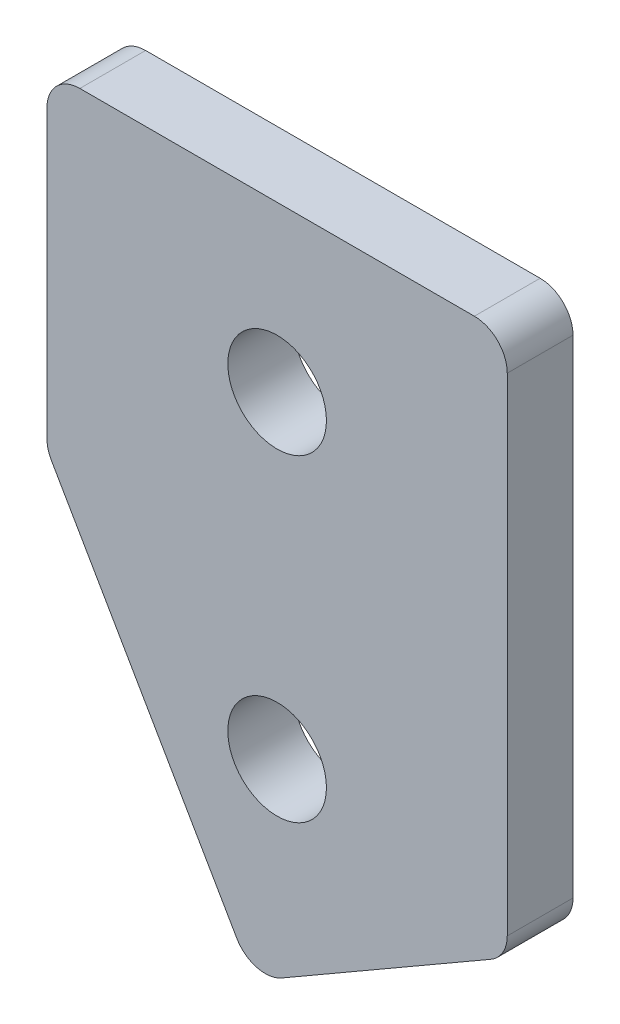
ISO-10303-21;
HEADER;
FILE_DESCRIPTION(('STEP AP214'),'2;1');
FILE_NAME('part.step','',(''),(''),'','','');
FILE_SCHEMA(('AUTOMOTIVE_DESIGN { 1 0 10303 214 1 1 1 1 }'));
ENDSEC;
DATA;
#1=APPLICATION_CONTEXT('core data for automotive mechanical design processes');
#2=APPLICATION_PROTOCOL_DEFINITION('international standard','automotive_design',2000,#1);
#3=PRODUCT_CONTEXT('',#1,'mechanical');
#4=PRODUCT('Part','Part','',(#3));
#5=PRODUCT_RELATED_PRODUCT_CATEGORY('part','',(#4));
#6=PRODUCT_DEFINITION_FORMATION('','',#4);
#7=PRODUCT_DEFINITION_CONTEXT('part definition',#1,'design');
#8=PRODUCT_DEFINITION('design','',#6,#7);
#9=PRODUCT_DEFINITION_SHAPE('','',#8);
#10=(LENGTH_UNIT() NAMED_UNIT(*) SI_UNIT(.MILLI.,.METRE.));
#11=(NAMED_UNIT(*) PLANE_ANGLE_UNIT() SI_UNIT($,.RADIAN.));
#12=(NAMED_UNIT(*) SI_UNIT($,.STERADIAN.) SOLID_ANGLE_UNIT());
#13=UNCERTAINTY_MEASURE_WITH_UNIT(LENGTH_MEASURE(1.E-05),#10,'distance_accuracy_value','');
#14=(GEOMETRIC_REPRESENTATION_CONTEXT(3) GLOBAL_UNCERTAINTY_ASSIGNED_CONTEXT((#13)) GLOBAL_UNIT_ASSIGNED_CONTEXT((#10,
#11,#12)) REPRESENTATION_CONTEXT('',''));
#15=CARTESIAN_POINT('',(0.,0.,0.));
#16=DIRECTION('',(0.,0.,1.));
#17=DIRECTION('',(1.,0.,0.));
#18=AXIS2_PLACEMENT_3D('',#15,#16,#17);
#19=CARTESIAN_POINT('',(0.,0.,2.));
#20=DIRECTION('',(0.,0.,-1.));
#21=DIRECTION('',(-1.,0.,0.));
#22=AXIS2_PLACEMENT_3D('',#19,#20,#21);
#23=PLANE('',#22);
#24=DIRECTION('',(0.500000000000001,-0.866025403784438,0.));
#25=VECTOR('',#24,1.);
#26=CARTESIAN_POINT('',(6.27216931783669,-10.8637159321677,2.));
#27=LINE('',#26,#25);
#28=CARTESIAN_POINT('',(0.133974596215564,-0.232050807568881,2.));
#29=VERTEX_POINT('',#28);
#30=CARTESIAN_POINT('',(5.77216931783669,-9.99769052838329,2.));
#31=VERTEX_POINT('',#30);
#32=EDGE_CURVE('E205',#29,#31,#27,.T.);
#33=ORIENTED_EDGE('',*,*,#32,.T.);
#34=CARTESIAN_POINT('',(6.63819472162113,-9.49769052838329,2.));
#35=DIRECTION('',(0.,0.,-1.));
#36=DIRECTION('',(-1.,0.,0.));
#37=AXIS2_PLACEMENT_3D('',#34,#35,#36);
#38=CIRCLE('',#37,1.);
#39=CARTESIAN_POINT('',(7.13819472162113,-10.3637159321677,2.));
#40=VERTEX_POINT('',#39);
#41=EDGE_CURVE('E174',#31,#40,#38,.F.);
#42=ORIENTED_EDGE('',*,*,#41,.T.);
#43=DIRECTION('',(0.866025403784438,0.500000000000002,0.));
#44=VECTOR('',#43,1.);
#45=CARTESIAN_POINT('',(14.,-6.40205080756887,2.));
#46=LINE('',#45,#44);
#47=CARTESIAN_POINT('',(13.5,-6.69072594216368,2.));
#48=VERTEX_POINT('',#47);
#49=EDGE_CURVE('E137',#40,#48,#46,.T.);
#50=ORIENTED_EDGE('',*,*,#49,.T.);
#51=CARTESIAN_POINT('',(13.,-5.82470053837924,2.));
#52=DIRECTION('',(0.,0.,-1.));
#53=DIRECTION('',(-1.,0.,0.));
#54=AXIS2_PLACEMENT_3D('',#51,#52,#53);
#55=CIRCLE('',#54,1.);
#56=CARTESIAN_POINT('',(14.,-5.82470053837924,2.));
#57=VERTEX_POINT('',#56);
#58=EDGE_CURVE('E172',#48,#57,#55,.F.);
#59=ORIENTED_EDGE('',*,*,#58,.T.);
#60=DIRECTION('',(0.,1.,0.));
#61=VECTOR('',#60,1.);
#62=CARTESIAN_POINT('',(14.,10.,2.));
#63=LINE('',#62,#61);
#64=CARTESIAN_POINT('',(14.,9.,2.));
#65=VERTEX_POINT('',#64);
#66=EDGE_CURVE('E202',#57,#65,#63,.T.);
#67=ORIENTED_EDGE('',*,*,#66,.T.);
#68=CARTESIAN_POINT('',(13.,9.,2.));
#69=DIRECTION('',(0.,0.,-1.));
#70=DIRECTION('',(-1.,0.,0.));
#71=AXIS2_PLACEMENT_3D('',#68,#69,#70);
#72=CIRCLE('',#71,1.);
#73=CARTESIAN_POINT('',(13.,10.,2.));
#74=VERTEX_POINT('',#73);
#75=EDGE_CURVE('E61',#65,#74,#72,.F.);
#76=ORIENTED_EDGE('',*,*,#75,.T.);
#77=DIRECTION('',(-1.,0.,0.));
#78=VECTOR('',#77,1.);
#79=CARTESIAN_POINT('',(0.,10.,2.));
#80=LINE('',#79,#78);
#81=CARTESIAN_POINT('',(1.,10.,2.));
#82=VERTEX_POINT('',#81);
#83=EDGE_CURVE('E156',#74,#82,#80,.T.);
#84=ORIENTED_EDGE('',*,*,#83,.T.);
#85=CARTESIAN_POINT('',(1.,9.,2.));
#86=DIRECTION('',(0.,0.,-1.));
#87=DIRECTION('',(-1.,0.,0.));
#88=AXIS2_PLACEMENT_3D('',#85,#86,#87);
#89=CIRCLE('',#88,1.);
#90=CARTESIAN_POINT('',(0.,9.,2.));
#91=VERTEX_POINT('',#90);
#92=EDGE_CURVE('E167',#82,#91,#89,.F.);
#93=ORIENTED_EDGE('',*,*,#92,.T.);
#94=DIRECTION('',(0.,-1.,0.));
#95=VECTOR('',#94,1.);
#96=CARTESIAN_POINT('',(0.,0.,2.));
#97=LINE('',#96,#95);
#98=CARTESIAN_POINT('',(0.,0.267949192431125,2.));
#99=VERTEX_POINT('',#98);
#100=EDGE_CURVE('E155',#91,#99,#97,.T.);
#101=ORIENTED_EDGE('',*,*,#100,.T.);
#102=CARTESIAN_POINT('',(1.,0.267949192431125,2.));
#103=DIRECTION('',(0.,0.,-1.));
#104=DIRECTION('',(-1.,0.,0.));
#105=AXIS2_PLACEMENT_3D('',#102,#103,#104);
#106=CIRCLE('',#105,1.);
#107=EDGE_CURVE('E169',#99,#29,#106,.F.);
#108=ORIENTED_EDGE('',*,*,#107,.T.);
#109=EDGE_LOOP('',(#33,#42,#50,#59,#67,#76,#84,#93,#101,#108));
#110=FACE_BOUND('',#109,.T.);
#111=CARTESIAN_POINT('',(7.,5.,2.));
#112=DIRECTION('',(0.,0.,1.));
#113=DIRECTION('',(1.,0.,0.));
#114=AXIS2_PLACEMENT_3D('',#111,#112,#113);
#115=CIRCLE('',#114,1.5);
#116=CARTESIAN_POINT('',(8.5,5.,2.));
#117=VERTEX_POINT('',#116);
#118=EDGE_CURVE('E196',#117,#117,#115,.T.);
#119=ORIENTED_EDGE('',*,*,#118,.F.);
#120=EDGE_LOOP('',(#119));
#121=FACE_BOUND('',#120,.T.);
#122=CARTESIAN_POINT('',(7.,-4.67,2.));
#123=DIRECTION('',(0.,0.,1.));
#124=DIRECTION('',(1.,0.,0.));
#125=AXIS2_PLACEMENT_3D('',#122,#123,#124);
#126=CIRCLE('',#125,1.5);
#127=CARTESIAN_POINT('',(8.5,-4.67,2.));
#128=VERTEX_POINT('',#127);
#129=EDGE_CURVE('E210',#128,#128,#126,.T.);
#130=ORIENTED_EDGE('',*,*,#129,.F.);
#131=EDGE_LOOP('',(#130));
#132=FACE_BOUND('',#131,.T.);
#133=ADVANCED_FACE('F39',(#110,#121,#132),#23,.F.);
#134=CARTESIAN_POINT('',(0.,0.,0.));
#135=DIRECTION('',(0.,0.,-1.));
#136=DIRECTION('',(-1.,0.,0.));
#137=AXIS2_PLACEMENT_3D('',#134,#135,#136);
#138=PLANE('',#137);
#139=CARTESIAN_POINT('',(7.,5.,0.));
#140=DIRECTION('',(0.,0.,1.));
#141=DIRECTION('',(1.,0.,0.));
#142=AXIS2_PLACEMENT_3D('',#139,#140,#141);
#143=CIRCLE('',#142,1.5);
#144=CARTESIAN_POINT('',(8.5,5.,0.));
#145=VERTEX_POINT('',#144);
#146=EDGE_CURVE('E198',#145,#145,#143,.T.);
#147=ORIENTED_EDGE('',*,*,#146,.T.);
#148=EDGE_LOOP('',(#147));
#149=FACE_BOUND('',#148,.T.);
#150=DIRECTION('',(0.866025403784438,0.500000000000002,0.));
#151=VECTOR('',#150,1.);
#152=CARTESIAN_POINT('',(14.,-6.40205080756887,0.));
#153=LINE('',#152,#151);
#154=CARTESIAN_POINT('',(7.13819472162113,-10.3637159321677,0.));
#155=VERTEX_POINT('',#154);
#156=CARTESIAN_POINT('',(13.5,-6.69072594216368,0.));
#157=VERTEX_POINT('',#156);
#158=EDGE_CURVE('E134',#155,#157,#153,.T.);
#159=ORIENTED_EDGE('',*,*,#158,.F.);
#160=CARTESIAN_POINT('',(6.63819472162113,-9.49769052838329,0.));
#161=DIRECTION('',(0.,0.,-1.));
#162=DIRECTION('',(-1.,0.,0.));
#163=AXIS2_PLACEMENT_3D('',#160,#161,#162);
#164=CIRCLE('',#163,1.);
#165=CARTESIAN_POINT('',(5.77216931783669,-9.99769052838329,0.));
#166=VERTEX_POINT('',#165);
#167=EDGE_CURVE('E117',#155,#166,#164,.T.);
#168=ORIENTED_EDGE('',*,*,#167,.T.);
#169=DIRECTION('',(0.500000000000001,-0.866025403784438,0.));
#170=VECTOR('',#169,1.);
#171=CARTESIAN_POINT('',(6.27216931783669,-10.8637159321677,0.));
#172=LINE('',#171,#170);
#173=CARTESIAN_POINT('',(0.133974596215564,-0.232050807568881,0.));
#174=VERTEX_POINT('',#173);
#175=EDGE_CURVE('E145',#174,#166,#172,.T.);
#176=ORIENTED_EDGE('',*,*,#175,.F.);
#177=CARTESIAN_POINT('',(1.,0.267949192431125,0.));
#178=DIRECTION('',(0.,0.,-1.));
#179=DIRECTION('',(-1.,0.,0.));
#180=AXIS2_PLACEMENT_3D('',#177,#178,#179);
#181=CIRCLE('',#180,1.);
#182=CARTESIAN_POINT('',(0.,0.267949192431125,0.));
#183=VERTEX_POINT('',#182);
#184=EDGE_CURVE('E159',#174,#183,#181,.T.);
#185=ORIENTED_EDGE('',*,*,#184,.T.);
#186=DIRECTION('',(0.,-1.,0.));
#187=VECTOR('',#186,1.);
#188=CARTESIAN_POINT('',(0.,0.,0.));
#189=LINE('',#188,#187);
#190=CARTESIAN_POINT('',(0.,9.,0.));
#191=VERTEX_POINT('',#190);
#192=EDGE_CURVE('E150',#191,#183,#189,.T.);
#193=ORIENTED_EDGE('',*,*,#192,.F.);
#194=CARTESIAN_POINT('',(1.,9.,0.));
#195=DIRECTION('',(0.,0.,-1.));
#196=DIRECTION('',(-1.,0.,0.));
#197=AXIS2_PLACEMENT_3D('',#194,#195,#196);
#198=CIRCLE('',#197,1.);
#199=CARTESIAN_POINT('',(1.,10.,0.));
#200=VERTEX_POINT('',#199);
#201=EDGE_CURVE('E138',#191,#200,#198,.T.);
#202=ORIENTED_EDGE('',*,*,#201,.T.);
#203=DIRECTION('',(-1.,0.,0.));
#204=VECTOR('',#203,1.);
#205=CARTESIAN_POINT('',(0.,10.,0.));
#206=LINE('',#205,#204);
#207=CARTESIAN_POINT('',(13.,10.,0.));
#208=VERTEX_POINT('',#207);
#209=EDGE_CURVE('E148',#208,#200,#206,.T.);
#210=ORIENTED_EDGE('',*,*,#209,.F.);
#211=CARTESIAN_POINT('',(13.,9.,0.));
#212=DIRECTION('',(0.,0.,-1.));
#213=DIRECTION('',(-1.,0.,0.));
#214=AXIS2_PLACEMENT_3D('',#211,#212,#213);
#215=CIRCLE('',#214,1.);
#216=CARTESIAN_POINT('',(14.,9.,0.));
#217=VERTEX_POINT('',#216);
#218=EDGE_CURVE('E161',#208,#217,#215,.T.);
#219=ORIENTED_EDGE('',*,*,#218,.T.);
#220=DIRECTION('',(0.,1.,0.));
#221=VECTOR('',#220,1.);
#222=CARTESIAN_POINT('',(14.,10.,0.));
#223=LINE('',#222,#221);
#224=CARTESIAN_POINT('',(14.,-5.82470053837924,0.));
#225=VERTEX_POINT('',#224);
#226=EDGE_CURVE('E144',#225,#217,#223,.T.);
#227=ORIENTED_EDGE('',*,*,#226,.F.);
#228=CARTESIAN_POINT('',(13.,-5.82470053837924,0.));
#229=DIRECTION('',(0.,0.,-1.));
#230=DIRECTION('',(-1.,0.,0.));
#231=AXIS2_PLACEMENT_3D('',#228,#229,#230);
#232=CIRCLE('',#231,1.);
#233=EDGE_CURVE('E128',#225,#157,#232,.T.);
#234=ORIENTED_EDGE('',*,*,#233,.T.);
#235=EDGE_LOOP('',(#159,#168,#176,#185,#193,#202,#210,#219,#227,#234));
#236=FACE_BOUND('',#235,.T.);
#237=CARTESIAN_POINT('',(7.,-4.67,0.));
#238=DIRECTION('',(0.,0.,1.));
#239=DIRECTION('',(1.,0.,0.));
#240=AXIS2_PLACEMENT_3D('',#237,#238,#239);
#241=CIRCLE('',#240,1.5);
#242=CARTESIAN_POINT('',(8.5,-4.67,0.));
#243=VERTEX_POINT('',#242);
#244=EDGE_CURVE('E212',#243,#243,#241,.T.);
#245=ORIENTED_EDGE('',*,*,#244,.T.);
#246=EDGE_LOOP('',(#245));
#247=FACE_BOUND('',#246,.T.);
#248=ADVANCED_FACE('F141',(#149,#236,#247),#138,.T.);
#249=CARTESIAN_POINT('',(0.,0.,2.));
#250=DIRECTION('',(1.,0.,0.));
#251=DIRECTION('',(0.,0.,-1.));
#252=AXIS2_PLACEMENT_3D('',#249,#250,#251);
#253=PLANE('',#252);
#254=ORIENTED_EDGE('',*,*,#192,.T.);
#255=DIRECTION('',(0.,0.,-1.));
#256=VECTOR('',#255,1.);
#257=CARTESIAN_POINT('',(0.,0.267949192431125,2.));
#258=LINE('',#257,#256);
#259=EDGE_CURVE('E11',#183,#99,#258,.F.);
#260=ORIENTED_EDGE('',*,*,#259,.T.);
#261=ORIENTED_EDGE('',*,*,#100,.F.);
#262=DIRECTION('',(0.,0.,-1.));
#263=VECTOR('',#262,1.);
#264=CARTESIAN_POINT('',(0.,9.,2.));
#265=LINE('',#264,#263);
#266=EDGE_CURVE('E47',#91,#191,#265,.T.);
#267=ORIENTED_EDGE('',*,*,#266,.T.);
#268=EDGE_LOOP('',(#254,#260,#261,#267));
#269=FACE_BOUND('',#268,.T.);
#270=ADVANCED_FACE('F190',(#269),#253,.F.);
#271=CARTESIAN_POINT('',(6.27216931783669,-10.8637159321677,2.));
#272=DIRECTION('',(0.866025403784438,0.500000000000001,0.));
#273=DIRECTION('',(-0.500000000000001,0.866025403784438,0.));
#274=AXIS2_PLACEMENT_3D('',#271,#272,#273);
#275=PLANE('',#274);
#276=ORIENTED_EDGE('',*,*,#175,.T.);
#277=DIRECTION('',(0.,0.,-1.));
#278=VECTOR('',#277,1.);
#279=CARTESIAN_POINT('',(5.77216931783669,-9.99769052838329,2.));
#280=LINE('',#279,#278);
#281=EDGE_CURVE('E122',#166,#31,#280,.F.);
#282=ORIENTED_EDGE('',*,*,#281,.T.);
#283=ORIENTED_EDGE('',*,*,#32,.F.);
#284=DIRECTION('',(0.,0.,-1.));
#285=VECTOR('',#284,1.);
#286=CARTESIAN_POINT('',(0.133974596215563,-0.232050807568879,2.));
#287=LINE('',#286,#285);
#288=EDGE_CURVE('E127',#29,#174,#287,.T.);
#289=ORIENTED_EDGE('',*,*,#288,.T.);
#290=EDGE_LOOP('',(#276,#282,#283,#289));
#291=FACE_BOUND('',#290,.T.);
#292=ADVANCED_FACE('F242',(#291),#275,.F.);
#293=CARTESIAN_POINT('',(14.,-6.40205080756887,2.));
#294=DIRECTION('',(-0.500000000000002,0.866025403784438,0.));
#295=DIRECTION('',(-0.866025403784438,-0.500000000000002,0.));
#296=AXIS2_PLACEMENT_3D('',#293,#294,#295);
#297=PLANE('',#296);
#298=ORIENTED_EDGE('',*,*,#49,.F.);
#299=DIRECTION('',(0.,0.,-1.));
#300=VECTOR('',#299,1.);
#301=CARTESIAN_POINT('',(7.13819472162113,-10.3637159321677,2.));
#302=LINE('',#301,#300);
#303=EDGE_CURVE('E121',#40,#155,#302,.T.);
#304=ORIENTED_EDGE('',*,*,#303,.T.);
#305=ORIENTED_EDGE('',*,*,#158,.T.);
#306=DIRECTION('',(0.,0.,-1.));
#307=VECTOR('',#306,1.);
#308=CARTESIAN_POINT('',(13.5,-6.69072594216368,2.));
#309=LINE('',#308,#307);
#310=EDGE_CURVE('E139',#157,#48,#309,.F.);
#311=ORIENTED_EDGE('',*,*,#310,.T.);
#312=EDGE_LOOP('',(#298,#304,#305,#311));
#313=FACE_BOUND('',#312,.T.);
#314=ADVANCED_FACE('F133',(#313),#297,.F.);
#315=CARTESIAN_POINT('',(14.,10.,2.));
#316=DIRECTION('',(-1.,0.,0.));
#317=DIRECTION('',(0.,-1.,0.));
#318=AXIS2_PLACEMENT_3D('',#315,#316,#317);
#319=PLANE('',#318);
#320=ORIENTED_EDGE('',*,*,#66,.F.);
#321=DIRECTION('',(0.,0.,-1.));
#322=VECTOR('',#321,1.);
#323=CARTESIAN_POINT('',(14.,-5.82470053837924,2.));
#324=LINE('',#323,#322);
#325=EDGE_CURVE('E178',#57,#225,#324,.T.);
#326=ORIENTED_EDGE('',*,*,#325,.T.);
#327=ORIENTED_EDGE('',*,*,#226,.T.);
#328=DIRECTION('',(0.,0.,-1.));
#329=VECTOR('',#328,1.);
#330=CARTESIAN_POINT('',(14.,9.,2.));
#331=LINE('',#330,#329);
#332=EDGE_CURVE('E176',#217,#65,#331,.F.);
#333=ORIENTED_EDGE('',*,*,#332,.T.);
#334=EDGE_LOOP('',(#320,#326,#327,#333));
#335=FACE_BOUND('',#334,.T.);
#336=ADVANCED_FACE('F236',(#335),#319,.F.);
#337=CARTESIAN_POINT('',(0.,10.,2.));
#338=DIRECTION('',(0.,-1.,0.));
#339=DIRECTION('',(1.,0.,0.));
#340=AXIS2_PLACEMENT_3D('',#337,#338,#339);
#341=PLANE('',#340);
#342=ORIENTED_EDGE('',*,*,#83,.F.);
#343=DIRECTION('',(0.,0.,-1.));
#344=VECTOR('',#343,1.);
#345=CARTESIAN_POINT('',(13.,10.,2.));
#346=LINE('',#345,#344);
#347=EDGE_CURVE('E182',#74,#208,#346,.T.);
#348=ORIENTED_EDGE('',*,*,#347,.T.);
#349=ORIENTED_EDGE('',*,*,#209,.T.);
#350=DIRECTION('',(0.,0.,-1.));
#351=VECTOR('',#350,1.);
#352=CARTESIAN_POINT('',(1.,10.,2.));
#353=LINE('',#352,#351);
#354=EDGE_CURVE('E54',#200,#82,#353,.F.);
#355=ORIENTED_EDGE('',*,*,#354,.T.);
#356=EDGE_LOOP('',(#342,#348,#349,#355));
#357=FACE_BOUND('',#356,.T.);
#358=ADVANCED_FACE('F233',(#357),#341,.F.);
#359=CARTESIAN_POINT('',(7.,5.,2.));
#360=DIRECTION('',(0.,0.,-1.));
#361=DIRECTION('',(-1.,0.,0.));
#362=AXIS2_PLACEMENT_3D('',#359,#360,#361);
#363=CYLINDRICAL_SURFACE('',#362,1.5);
#364=ORIENTED_EDGE('',*,*,#118,.T.);
#365=EDGE_LOOP('',(#364));
#366=FACE_BOUND('',#365,.T.);
#367=ORIENTED_EDGE('',*,*,#146,.F.);
#368=EDGE_LOOP('',(#367));
#369=FACE_BOUND('',#368,.T.);
#370=ADVANCED_FACE('F230',(#366,#369),#363,.F.);
#371=CARTESIAN_POINT('',(7.,-4.67,2.));
#372=DIRECTION('',(0.,0.,-1.));
#373=DIRECTION('',(-1.,0.,0.));
#374=AXIS2_PLACEMENT_3D('',#371,#372,#373);
#375=CYLINDRICAL_SURFACE('',#374,1.5);
#376=ORIENTED_EDGE('',*,*,#129,.T.);
#377=EDGE_LOOP('',(#376));
#378=FACE_BOUND('',#377,.T.);
#379=ORIENTED_EDGE('',*,*,#244,.F.);
#380=EDGE_LOOP('',(#379));
#381=FACE_BOUND('',#380,.T.);
#382=ADVANCED_FACE('F218',(#378,#381),#375,.F.);
#383=CARTESIAN_POINT('',(6.63819472162113,-9.49769052838329,2.));
#384=DIRECTION('',(0.,0.,-1.));
#385=DIRECTION('',(-1.,0.,0.));
#386=AXIS2_PLACEMENT_3D('',#383,#384,#385);
#387=CYLINDRICAL_SURFACE('',#386,1.);
#388=ORIENTED_EDGE('',*,*,#41,.F.);
#389=ORIENTED_EDGE('',*,*,#281,.F.);
#390=ORIENTED_EDGE('',*,*,#167,.F.);
#391=ORIENTED_EDGE('',*,*,#303,.F.);
#392=EDGE_LOOP('',(#388,#389,#390,#391));
#393=FACE_BOUND('',#392,.T.);
#394=ADVANCED_FACE('F120',(#393),#387,.T.);
#395=CARTESIAN_POINT('',(13.,-5.82470053837924,2.));
#396=DIRECTION('',(0.,0.,-1.));
#397=DIRECTION('',(-1.,0.,0.));
#398=AXIS2_PLACEMENT_3D('',#395,#396,#397);
#399=CYLINDRICAL_SURFACE('',#398,1.);
#400=ORIENTED_EDGE('',*,*,#58,.F.);
#401=ORIENTED_EDGE('',*,*,#310,.F.);
#402=ORIENTED_EDGE('',*,*,#233,.F.);
#403=ORIENTED_EDGE('',*,*,#325,.F.);
#404=EDGE_LOOP('',(#400,#401,#402,#403));
#405=FACE_BOUND('',#404,.T.);
#406=ADVANCED_FACE('F250',(#405),#399,.T.);
#407=CARTESIAN_POINT('',(13.,9.,2.));
#408=DIRECTION('',(0.,0.,-1.));
#409=DIRECTION('',(-1.,0.,0.));
#410=AXIS2_PLACEMENT_3D('',#407,#408,#409);
#411=CYLINDRICAL_SURFACE('',#410,1.);
#412=ORIENTED_EDGE('',*,*,#75,.F.);
#413=ORIENTED_EDGE('',*,*,#332,.F.);
#414=ORIENTED_EDGE('',*,*,#218,.F.);
#415=ORIENTED_EDGE('',*,*,#347,.F.);
#416=EDGE_LOOP('',(#412,#413,#414,#415));
#417=FACE_BOUND('',#416,.T.);
#418=ADVANCED_FACE('F253',(#417),#411,.T.);
#419=CARTESIAN_POINT('',(1.,0.267949192431125,2.));
#420=DIRECTION('',(0.,0.,-1.));
#421=DIRECTION('',(-1.,0.,0.));
#422=AXIS2_PLACEMENT_3D('',#419,#420,#421);
#423=CYLINDRICAL_SURFACE('',#422,1.);
#424=ORIENTED_EDGE('',*,*,#107,.F.);
#425=ORIENTED_EDGE('',*,*,#259,.F.);
#426=ORIENTED_EDGE('',*,*,#184,.F.);
#427=ORIENTED_EDGE('',*,*,#288,.F.);
#428=EDGE_LOOP('',(#424,#425,#426,#427));
#429=FACE_BOUND('',#428,.T.);
#430=ADVANCED_FACE('F256',(#429),#423,.T.);
#431=CARTESIAN_POINT('',(1.,9.,2.));
#432=DIRECTION('',(0.,0.,-1.));
#433=DIRECTION('',(-1.,0.,0.));
#434=AXIS2_PLACEMENT_3D('',#431,#432,#433);
#435=CYLINDRICAL_SURFACE('',#434,1.);
#436=ORIENTED_EDGE('',*,*,#92,.F.);
#437=ORIENTED_EDGE('',*,*,#354,.F.);
#438=ORIENTED_EDGE('',*,*,#201,.F.);
#439=ORIENTED_EDGE('',*,*,#266,.F.);
#440=EDGE_LOOP('',(#436,#437,#438,#439));
#441=FACE_BOUND('',#440,.T.);
#442=ADVANCED_FACE('F41',(#441),#435,.T.);
#443=CLOSED_SHELL('',(#133,#248,#270,#292,#314,#336,#358,#370,#382,#394,#406,#418,#430,#442));
#444=MANIFOLD_SOLID_BREP('B2',#443);
#445=ADVANCED_BREP_SHAPE_REPRESENTATION('',(#18,#444),#14);
#446=SHAPE_DEFINITION_REPRESENTATION(#9,#445);
ENDSEC;
END-ISO-10303-21;
